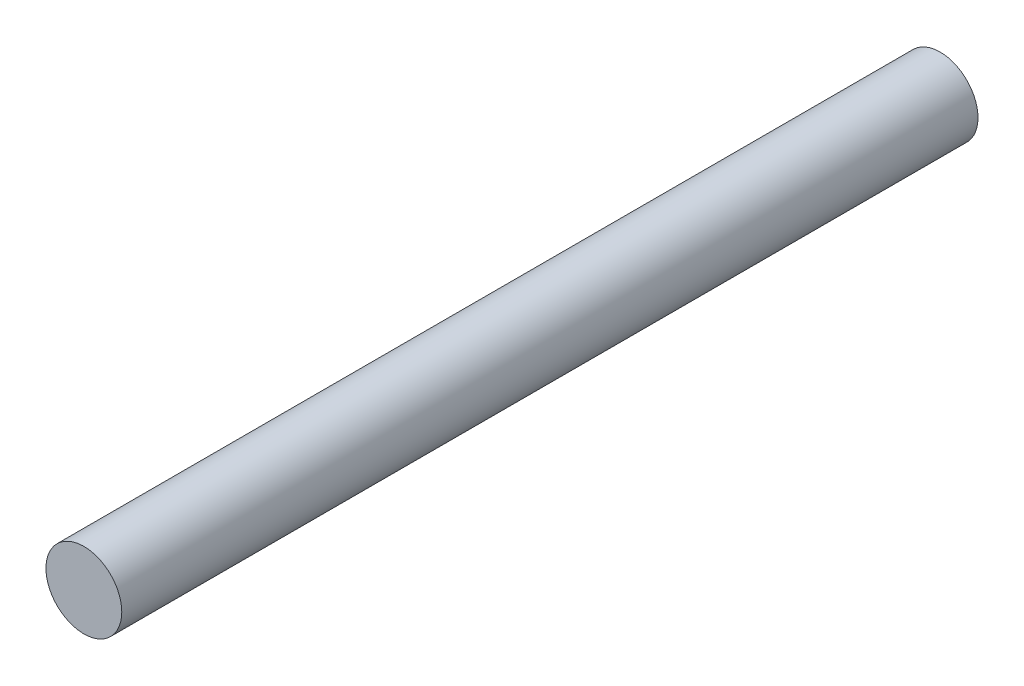
ISO-10303-21;
HEADER;
FILE_DESCRIPTION(('STEP AP214'),'2;1');
FILE_NAME('part.step','',(''),(''),'','','');
FILE_SCHEMA(('AUTOMOTIVE_DESIGN { 1 0 10303 214 1 1 1 1 }'));
ENDSEC;
DATA;
#1=APPLICATION_CONTEXT('core data for automotive mechanical design processes');
#2=APPLICATION_PROTOCOL_DEFINITION('international standard','automotive_design',2000,#1);
#3=PRODUCT_CONTEXT('',#1,'mechanical');
#4=PRODUCT('Part','Part','',(#3));
#5=PRODUCT_RELATED_PRODUCT_CATEGORY('part','',(#4));
#6=PRODUCT_DEFINITION_FORMATION('','',#4);
#7=PRODUCT_DEFINITION_CONTEXT('part definition',#1,'design');
#8=PRODUCT_DEFINITION('design','',#6,#7);
#9=PRODUCT_DEFINITION_SHAPE('','',#8);
#10=(LENGTH_UNIT() NAMED_UNIT(*) SI_UNIT(.MILLI.,.METRE.));
#11=(NAMED_UNIT(*) PLANE_ANGLE_UNIT() SI_UNIT($,.RADIAN.));
#12=(NAMED_UNIT(*) SI_UNIT($,.STERADIAN.) SOLID_ANGLE_UNIT());
#13=UNCERTAINTY_MEASURE_WITH_UNIT(LENGTH_MEASURE(1.E-05),#10,'distance_accuracy_value','');
#14=(GEOMETRIC_REPRESENTATION_CONTEXT(3) GLOBAL_UNCERTAINTY_ASSIGNED_CONTEXT((#13)) GLOBAL_UNIT_ASSIGNED_CONTEXT((#10,
#11,#12)) REPRESENTATION_CONTEXT('',''));
#15=CARTESIAN_POINT('',(0.,0.,0.));
#16=DIRECTION('',(0.,0.,1.));
#17=DIRECTION('',(1.,0.,0.));
#18=AXIS2_PLACEMENT_3D('',#15,#16,#17);
#19=CARTESIAN_POINT('',(-11.0125057867816,8.01781485468245,112.900235935117));
#20=DIRECTION('',(0.,0.,-1.));
#21=DIRECTION('',(-1.,0.,0.));
#22=AXIS2_PLACEMENT_3D('',#19,#20,#21);
#23=CYLINDRICAL_SURFACE('',#22,10.);
#24=CARTESIAN_POINT('',(-11.0125057867816,8.01781485468245,112.900235935117));
#25=DIRECTION('',(0.,0.,1.));
#26=DIRECTION('',(1.,0.,0.));
#27=AXIS2_PLACEMENT_3D('',#24,#25,#26);
#28=CIRCLE('',#27,10.);
#29=CARTESIAN_POINT('',(-1.01250578678159,8.01781485468245,112.900235935117));
#30=VERTEX_POINT('',#29);
#31=EDGE_CURVE('E10',#30,#30,#28,.T.);
#32=ORIENTED_EDGE('',*,*,#31,.F.);
#33=EDGE_LOOP('',(#32));
#34=FACE_BOUND('',#33,.T.);
#35=CARTESIAN_POINT('',(-11.0125057867816,8.01781485468245,-112.900235935117));
#36=DIRECTION('',(0.,0.,1.));
#37=DIRECTION('',(1.,0.,0.));
#38=AXIS2_PLACEMENT_3D('',#35,#36,#37);
#39=CIRCLE('',#38,10.);
#40=CARTESIAN_POINT('',(-1.01250578678159,8.01781485468245,-112.900235935117));
#41=VERTEX_POINT('',#40);
#42=EDGE_CURVE('E33',#41,#41,#39,.T.);
#43=ORIENTED_EDGE('',*,*,#42,.T.);
#44=EDGE_LOOP('',(#43));
#45=FACE_BOUND('',#44,.T.);
#46=ADVANCED_FACE('F30',(#34,#45),#23,.T.);
#47=CARTESIAN_POINT('',(-11.0125057867816,8.01781485468245,112.900235935117));
#48=DIRECTION('',(0.,0.,1.));
#49=DIRECTION('',(1.,0.,0.));
#50=AXIS2_PLACEMENT_3D('',#47,#48,#49);
#51=PLANE('',#50);
#52=ORIENTED_EDGE('',*,*,#31,.T.);
#53=EDGE_LOOP('',(#52));
#54=FACE_BOUND('',#53,.T.);
#55=ADVANCED_FACE('F45',(#54),#51,.T.);
#56=CARTESIAN_POINT('',(-11.0125057867816,8.01781485468245,-112.900235935117));
#57=DIRECTION('',(0.,0.,1.));
#58=DIRECTION('',(1.,0.,0.));
#59=AXIS2_PLACEMENT_3D('',#56,#57,#58);
#60=PLANE('',#59);
#61=ORIENTED_EDGE('',*,*,#42,.F.);
#62=EDGE_LOOP('',(#61));
#63=FACE_BOUND('',#62,.T.);
#64=ADVANCED_FACE('F43',(#63),#60,.F.);
#65=CLOSED_SHELL('',(#46,#55,#64));
#66=MANIFOLD_SOLID_BREP('B2',#65);
#67=ADVANCED_BREP_SHAPE_REPRESENTATION('',(#18,#66),#14);
#68=SHAPE_DEFINITION_REPRESENTATION(#9,#67);
ENDSEC;
END-ISO-10303-21;
